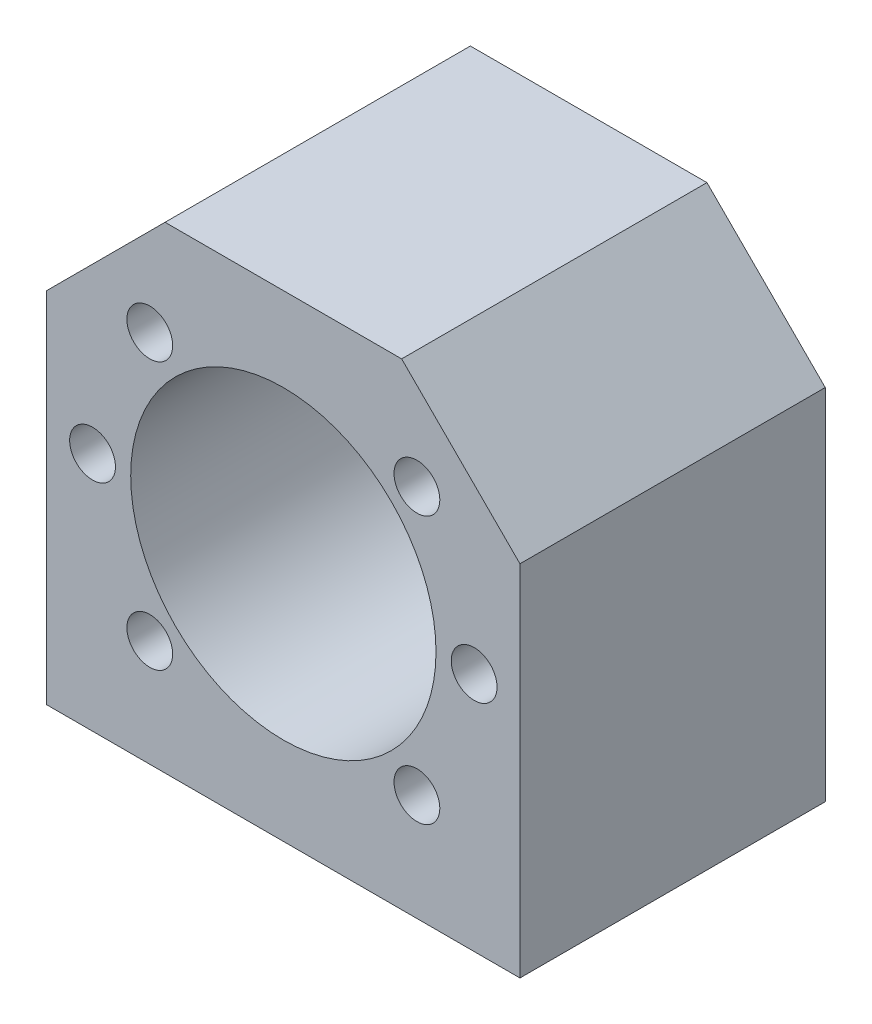
ISO-10303-21;
HEADER;
FILE_DESCRIPTION(('STEP AP214'),'2;1');
FILE_NAME('part.step','',(''),(''),'','','');
FILE_SCHEMA(('AUTOMOTIVE_DESIGN { 1 0 10303 214 1 1 1 1 }'));
ENDSEC;
DATA;
#1=APPLICATION_CONTEXT('core data for automotive mechanical design processes');
#2=APPLICATION_PROTOCOL_DEFINITION('international standard','automotive_design',2000,#1);
#3=PRODUCT_CONTEXT('',#1,'mechanical');
#4=PRODUCT('Part','Part','',(#3));
#5=PRODUCT_RELATED_PRODUCT_CATEGORY('part','',(#4));
#6=PRODUCT_DEFINITION_FORMATION('','',#4);
#7=PRODUCT_DEFINITION_CONTEXT('part definition',#1,'design');
#8=PRODUCT_DEFINITION('design','',#6,#7);
#9=PRODUCT_DEFINITION_SHAPE('','',#8);
#10=(LENGTH_UNIT() NAMED_UNIT(*) SI_UNIT(.MILLI.,.METRE.));
#11=(NAMED_UNIT(*) PLANE_ANGLE_UNIT() SI_UNIT($,.RADIAN.));
#12=(NAMED_UNIT(*) SI_UNIT($,.STERADIAN.) SOLID_ANGLE_UNIT());
#13=UNCERTAINTY_MEASURE_WITH_UNIT(LENGTH_MEASURE(1.E-05),#10,'distance_accuracy_value','');
#14=(GEOMETRIC_REPRESENTATION_CONTEXT(3) GLOBAL_UNCERTAINTY_ASSIGNED_CONTEXT((#13)) GLOBAL_UNIT_ASSIGNED_CONTEXT((#10,
#11,#12)) REPRESENTATION_CONTEXT('',''));
#15=CARTESIAN_POINT('',(0.,0.,0.));
#16=DIRECTION('',(0.,0.,1.));
#17=DIRECTION('',(1.,0.,0.));
#18=AXIS2_PLACEMENT_3D('',#15,#16,#17);
#19=CARTESIAN_POINT('',(31.,-31.4999999999999,40.));
#20=DIRECTION('',(0.,1.,0.));
#21=DIRECTION('',(-1.,0.,0.));
#22=AXIS2_PLACEMENT_3D('',#19,#20,#21);
#23=PLANE('',#22);
#24=CARTESIAN_POINT('',(-26.,-31.4999999999999,7.));
#25=DIRECTION('',(0.,-1.,0.));
#26=DIRECTION('',(1.,0.,0.));
#27=AXIS2_PLACEMENT_3D('',#24,#25,#26);
#28=CIRCLE('',#27,2.99999999999999);
#29=CARTESIAN_POINT('',(-23.,-31.4999999999999,7.));
#30=VERTEX_POINT('',#29);
#31=EDGE_CURVE('E164',#30,#30,#28,.T.);
#32=ORIENTED_EDGE('',*,*,#31,.F.);
#33=EDGE_LOOP('',(#32));
#34=FACE_BOUND('',#33,.T.);
#35=CARTESIAN_POINT('',(26.,-31.4999999999999,33.));
#36=DIRECTION('',(0.,-1.,0.));
#37=DIRECTION('',(1.,0.,0.));
#38=AXIS2_PLACEMENT_3D('',#35,#36,#37);
#39=CIRCLE('',#38,3.);
#40=CARTESIAN_POINT('',(29.,-31.4999999999999,33.));
#41=VERTEX_POINT('',#40);
#42=EDGE_CURVE('E168',#41,#41,#39,.T.);
#43=ORIENTED_EDGE('',*,*,#42,.F.);
#44=EDGE_LOOP('',(#43));
#45=FACE_BOUND('',#44,.T.);
#46=CARTESIAN_POINT('',(26.,-31.4999999999999,7.));
#47=DIRECTION('',(0.,-1.,0.));
#48=DIRECTION('',(1.,0.,0.));
#49=AXIS2_PLACEMENT_3D('',#46,#47,#48);
#50=CIRCLE('',#49,3.);
#51=CARTESIAN_POINT('',(29.,-31.4999999999999,7.));
#52=VERTEX_POINT('',#51);
#53=EDGE_CURVE('E172',#52,#52,#50,.T.);
#54=ORIENTED_EDGE('',*,*,#53,.F.);
#55=EDGE_LOOP('',(#54));
#56=FACE_BOUND('',#55,.T.);
#57=CARTESIAN_POINT('',(-26.,-31.4999999999999,33.));
#58=DIRECTION('',(0.,-1.,0.));
#59=DIRECTION('',(1.,0.,0.));
#60=AXIS2_PLACEMENT_3D('',#57,#58,#59);
#61=CIRCLE('',#60,3.);
#62=CARTESIAN_POINT('',(-23.,-31.4999999999999,33.));
#63=VERTEX_POINT('',#62);
#64=EDGE_CURVE('E175',#63,#63,#61,.T.);
#65=ORIENTED_EDGE('',*,*,#64,.F.);
#66=EDGE_LOOP('',(#65));
#67=FACE_BOUND('',#66,.T.);
#68=DIRECTION('',(1.,0.,0.));
#69=VECTOR('',#68,1.);
#70=CARTESIAN_POINT('',(31.,-31.4999999999999,0.));
#71=LINE('',#70,#69);
#72=CARTESIAN_POINT('',(-31.,-31.4999999999999,0.));
#73=VERTEX_POINT('',#72);
#74=CARTESIAN_POINT('',(31.,-31.4999999999999,0.));
#75=VERTEX_POINT('',#74);
#76=EDGE_CURVE('E118',#73,#75,#71,.T.);
#77=ORIENTED_EDGE('',*,*,#76,.T.);
#78=DIRECTION('',(0.,0.,-1.));
#79=VECTOR('',#78,1.);
#80=CARTESIAN_POINT('',(31.,-31.4999999999999,40.));
#81=LINE('',#80,#79);
#82=CARTESIAN_POINT('',(31.,-31.4999999999999,40.));
#83=VERTEX_POINT('',#82);
#84=EDGE_CURVE('E11',#83,#75,#81,.T.);
#85=ORIENTED_EDGE('',*,*,#84,.F.);
#86=DIRECTION('',(1.,0.,0.));
#87=VECTOR('',#86,1.);
#88=CARTESIAN_POINT('',(31.,-31.4999999999999,40.));
#89=LINE('',#88,#87);
#90=CARTESIAN_POINT('',(-31.,-31.4999999999999,40.));
#91=VERTEX_POINT('',#90);
#92=EDGE_CURVE('E129',#91,#83,#89,.T.);
#93=ORIENTED_EDGE('',*,*,#92,.F.);
#94=DIRECTION('',(0.,0.,-1.));
#95=VECTOR('',#94,1.);
#96=CARTESIAN_POINT('',(-31.,-31.4999999999999,40.));
#97=LINE('',#96,#95);
#98=EDGE_CURVE('E114',#91,#73,#97,.T.);
#99=ORIENTED_EDGE('',*,*,#98,.T.);
#100=EDGE_LOOP('',(#77,#85,#93,#99));
#101=FACE_BOUND('',#100,.T.);
#102=ADVANCED_FACE('F34',(#34,#45,#56,#67,#101),#23,.F.);
#103=CARTESIAN_POINT('',(31.,-31.4999999999999,40.));
#104=DIRECTION('',(-1.,0.,0.));
#105=DIRECTION('',(0.,0.,1.));
#106=AXIS2_PLACEMENT_3D('',#103,#104,#105);
#107=PLANE('',#106);
#108=DIRECTION('',(0.,1.,0.));
#109=VECTOR('',#108,1.);
#110=CARTESIAN_POINT('',(31.,-31.4999999999999,0.));
#111=LINE('',#110,#109);
#112=CARTESIAN_POINT('',(31.,15.5000000000001,0.));
#113=VERTEX_POINT('',#112);
#114=EDGE_CURVE('E121',#75,#113,#111,.T.);
#115=ORIENTED_EDGE('',*,*,#114,.T.);
#116=DIRECTION('',(0.,0.,-1.));
#117=VECTOR('',#116,1.);
#118=CARTESIAN_POINT('',(31.,15.5000000000001,40.));
#119=LINE('',#118,#117);
#120=CARTESIAN_POINT('',(31.,15.5000000000001,40.));
#121=VERTEX_POINT('',#120);
#122=EDGE_CURVE('E42',#121,#113,#119,.T.);
#123=ORIENTED_EDGE('',*,*,#122,.F.);
#124=DIRECTION('',(0.,1.,0.));
#125=VECTOR('',#124,1.);
#126=CARTESIAN_POINT('',(31.,-31.4999999999999,40.));
#127=LINE('',#126,#125);
#128=EDGE_CURVE('E87',#83,#121,#127,.T.);
#129=ORIENTED_EDGE('',*,*,#128,.F.);
#130=ORIENTED_EDGE('',*,*,#84,.T.);
#131=EDGE_LOOP('',(#115,#123,#129,#130));
#132=FACE_BOUND('',#131,.T.);
#133=ADVANCED_FACE('F154',(#132),#107,.F.);
#134=CARTESIAN_POINT('',(31.,15.5000000000001,40.));
#135=DIRECTION('',(-0.707106781186546,-0.707106781186549,0.));
#136=DIRECTION('',(0.707106781186549,-0.707106781186546,0.));
#137=AXIS2_PLACEMENT_3D('',#134,#135,#136);
#138=PLANE('',#137);
#139=DIRECTION('',(-0.707106781186549,0.707106781186546,0.));
#140=VECTOR('',#139,1.);
#141=CARTESIAN_POINT('',(31.,15.5000000000001,0.));
#142=LINE('',#141,#140);
#143=CARTESIAN_POINT('',(15.5,31.,0.));
#144=VERTEX_POINT('',#143);
#145=EDGE_CURVE('E124',#113,#144,#142,.T.);
#146=ORIENTED_EDGE('',*,*,#145,.T.);
#147=DIRECTION('',(0.,0.,-1.));
#148=VECTOR('',#147,1.);
#149=CARTESIAN_POINT('',(15.5,31.,40.));
#150=LINE('',#149,#148);
#151=CARTESIAN_POINT('',(15.5,31.,40.));
#152=VERTEX_POINT('',#151);
#153=EDGE_CURVE('E109',#152,#144,#150,.T.);
#154=ORIENTED_EDGE('',*,*,#153,.F.);
#155=DIRECTION('',(-0.707106781186549,0.707106781186546,0.));
#156=VECTOR('',#155,1.);
#157=CARTESIAN_POINT('',(31.,15.5000000000001,40.));
#158=LINE('',#157,#156);
#159=EDGE_CURVE('E100',#121,#152,#158,.T.);
#160=ORIENTED_EDGE('',*,*,#159,.F.);
#161=ORIENTED_EDGE('',*,*,#122,.T.);
#162=EDGE_LOOP('',(#146,#154,#160,#161));
#163=FACE_BOUND('',#162,.T.);
#164=ADVANCED_FACE('F135',(#163),#138,.F.);
#165=CARTESIAN_POINT('',(15.5,31.,40.));
#166=DIRECTION('',(0.,-1.,0.));
#167=DIRECTION('',(1.,0.,0.));
#168=AXIS2_PLACEMENT_3D('',#165,#166,#167);
#169=PLANE('',#168);
#170=DIRECTION('',(-1.,0.,0.));
#171=VECTOR('',#170,1.);
#172=CARTESIAN_POINT('',(15.5,31.,0.));
#173=LINE('',#172,#171);
#174=CARTESIAN_POINT('',(-15.5,31.,0.));
#175=VERTEX_POINT('',#174);
#176=EDGE_CURVE('E108',#144,#175,#173,.T.);
#177=ORIENTED_EDGE('',*,*,#176,.T.);
#178=DIRECTION('',(0.,0.,-1.));
#179=VECTOR('',#178,1.);
#180=CARTESIAN_POINT('',(-15.5,31.,40.));
#181=LINE('',#180,#179);
#182=CARTESIAN_POINT('',(-15.5,31.,40.));
#183=VERTEX_POINT('',#182);
#184=EDGE_CURVE('E105',#183,#175,#181,.T.);
#185=ORIENTED_EDGE('',*,*,#184,.F.);
#186=DIRECTION('',(-1.,0.,0.));
#187=VECTOR('',#186,1.);
#188=CARTESIAN_POINT('',(15.5,31.,40.));
#189=LINE('',#188,#187);
#190=EDGE_CURVE('E94',#152,#183,#189,.T.);
#191=ORIENTED_EDGE('',*,*,#190,.F.);
#192=ORIENTED_EDGE('',*,*,#153,.T.);
#193=EDGE_LOOP('',(#177,#185,#191,#192));
#194=FACE_BOUND('',#193,.T.);
#195=ADVANCED_FACE('F106',(#194),#169,.F.);
#196=CARTESIAN_POINT('',(-15.5,31.,40.));
#197=DIRECTION('',(0.707106781186545,-0.70710678118655,0.));
#198=DIRECTION('',(0.70710678118655,0.707106781186545,0.));
#199=AXIS2_PLACEMENT_3D('',#196,#197,#198);
#200=PLANE('',#199);
#201=DIRECTION('',(-0.70710678118655,-0.707106781186545,0.));
#202=VECTOR('',#201,1.);
#203=CARTESIAN_POINT('',(-15.5,31.,0.));
#204=LINE('',#203,#202);
#205=CARTESIAN_POINT('',(-31.,15.5000000000001,0.));
#206=VERTEX_POINT('',#205);
#207=EDGE_CURVE('E73',#175,#206,#204,.T.);
#208=ORIENTED_EDGE('',*,*,#207,.T.);
#209=DIRECTION('',(0.,0.,-1.));
#210=VECTOR('',#209,1.);
#211=CARTESIAN_POINT('',(-31.,15.5000000000001,40.));
#212=LINE('',#211,#210);
#213=CARTESIAN_POINT('',(-31.,15.5000000000001,40.));
#214=VERTEX_POINT('',#213);
#215=EDGE_CURVE('E110',#214,#206,#212,.T.);
#216=ORIENTED_EDGE('',*,*,#215,.F.);
#217=DIRECTION('',(-0.70710678118655,-0.707106781186545,0.));
#218=VECTOR('',#217,1.);
#219=CARTESIAN_POINT('',(-15.5,31.,40.));
#220=LINE('',#219,#218);
#221=EDGE_CURVE('E98',#183,#214,#220,.T.);
#222=ORIENTED_EDGE('',*,*,#221,.F.);
#223=ORIENTED_EDGE('',*,*,#184,.T.);
#224=EDGE_LOOP('',(#208,#216,#222,#223));
#225=FACE_BOUND('',#224,.T.);
#226=ADVANCED_FACE('F112',(#225),#200,.F.);
#227=CARTESIAN_POINT('',(-31.,15.5000000000001,40.));
#228=DIRECTION('',(1.,0.,0.));
#229=DIRECTION('',(0.,1.,0.));
#230=AXIS2_PLACEMENT_3D('',#227,#228,#229);
#231=PLANE('',#230);
#232=DIRECTION('',(0.,-1.,0.));
#233=VECTOR('',#232,1.);
#234=CARTESIAN_POINT('',(-31.,15.5000000000001,0.));
#235=LINE('',#234,#233);
#236=EDGE_CURVE('E79',#206,#73,#235,.T.);
#237=ORIENTED_EDGE('',*,*,#236,.T.);
#238=ORIENTED_EDGE('',*,*,#98,.F.);
#239=DIRECTION('',(0.,-1.,0.));
#240=VECTOR('',#239,1.);
#241=CARTESIAN_POINT('',(-31.,15.5000000000001,40.));
#242=LINE('',#241,#240);
#243=EDGE_CURVE('E50',#214,#91,#242,.T.);
#244=ORIENTED_EDGE('',*,*,#243,.F.);
#245=ORIENTED_EDGE('',*,*,#215,.T.);
#246=EDGE_LOOP('',(#237,#238,#244,#245));
#247=FACE_BOUND('',#246,.T.);
#248=ADVANCED_FACE('F142',(#247),#231,.F.);
#249=CARTESIAN_POINT('',(0.,0.,40.));
#250=DIRECTION('',(0.,0.,1.));
#251=DIRECTION('',(1.,0.,0.));
#252=AXIS2_PLACEMENT_3D('',#249,#250,#251);
#253=PLANE('',#252);
#254=CARTESIAN_POINT('',(-17.5,-17.5,40.));
#255=DIRECTION('',(0.,0.,1.));
#256=DIRECTION('',(1.,0.,0.));
#257=AXIS2_PLACEMENT_3D('',#254,#255,#256);
#258=CIRCLE('',#257,3.);
#259=CARTESIAN_POINT('',(-14.5,-17.5,40.));
#260=VERTEX_POINT('',#259);
#261=EDGE_CURVE('E181',#260,#260,#258,.T.);
#262=ORIENTED_EDGE('',*,*,#261,.F.);
#263=EDGE_LOOP('',(#262));
#264=FACE_BOUND('',#263,.T.);
#265=CARTESIAN_POINT('',(-17.5,17.5,40.));
#266=DIRECTION('',(0.,0.,1.));
#267=DIRECTION('',(1.,0.,0.));
#268=AXIS2_PLACEMENT_3D('',#265,#266,#267);
#269=CIRCLE('',#268,3.);
#270=CARTESIAN_POINT('',(-14.5,17.5,40.));
#271=VERTEX_POINT('',#270);
#272=EDGE_CURVE('E209',#271,#271,#269,.T.);
#273=ORIENTED_EDGE('',*,*,#272,.F.);
#274=EDGE_LOOP('',(#273));
#275=FACE_BOUND('',#274,.T.);
#276=CARTESIAN_POINT('',(-25.,0.,40.));
#277=DIRECTION('',(0.,0.,1.));
#278=DIRECTION('',(1.,0.,0.));
#279=AXIS2_PLACEMENT_3D('',#276,#277,#278);
#280=CIRCLE('',#279,3.);
#281=CARTESIAN_POINT('',(-22.,0.,40.));
#282=VERTEX_POINT('',#281);
#283=EDGE_CURVE('E203',#282,#282,#280,.T.);
#284=ORIENTED_EDGE('',*,*,#283,.F.);
#285=EDGE_LOOP('',(#284));
#286=FACE_BOUND('',#285,.T.);
#287=CARTESIAN_POINT('',(17.5,17.5,40.));
#288=DIRECTION('',(0.,0.,1.));
#289=DIRECTION('',(1.,0.,0.));
#290=AXIS2_PLACEMENT_3D('',#287,#288,#289);
#291=CIRCLE('',#290,3.);
#292=CARTESIAN_POINT('',(20.5,17.5,40.));
#293=VERTEX_POINT('',#292);
#294=EDGE_CURVE('E197',#293,#293,#291,.T.);
#295=ORIENTED_EDGE('',*,*,#294,.F.);
#296=EDGE_LOOP('',(#295));
#297=FACE_BOUND('',#296,.T.);
#298=CARTESIAN_POINT('',(25.,0.,40.));
#299=DIRECTION('',(0.,0.,1.));
#300=DIRECTION('',(1.,0.,0.));
#301=AXIS2_PLACEMENT_3D('',#298,#299,#300);
#302=CIRCLE('',#301,3.00000000000002);
#303=CARTESIAN_POINT('',(28.,0.,40.));
#304=VERTEX_POINT('',#303);
#305=EDGE_CURVE('E191',#304,#304,#302,.T.);
#306=ORIENTED_EDGE('',*,*,#305,.F.);
#307=EDGE_LOOP('',(#306));
#308=FACE_BOUND('',#307,.T.);
#309=CARTESIAN_POINT('',(17.5,-17.5,40.));
#310=DIRECTION('',(0.,0.,1.));
#311=DIRECTION('',(1.,0.,0.));
#312=AXIS2_PLACEMENT_3D('',#309,#310,#311);
#313=CIRCLE('',#312,3.);
#314=CARTESIAN_POINT('',(20.5,-17.5,40.));
#315=VERTEX_POINT('',#314);
#316=EDGE_CURVE('E190',#315,#315,#313,.T.);
#317=ORIENTED_EDGE('',*,*,#316,.F.);
#318=EDGE_LOOP('',(#317));
#319=FACE_BOUND('',#318,.T.);
#320=CARTESIAN_POINT('',(0.,0.,40.));
#321=DIRECTION('',(0.,0.,1.));
#322=DIRECTION('',(1.,0.,0.));
#323=AXIS2_PLACEMENT_3D('',#320,#321,#322);
#324=CIRCLE('',#323,20.0000000000007);
#325=CARTESIAN_POINT('',(20.0000000000007,0.,40.));
#326=VERTEX_POINT('',#325);
#327=EDGE_CURVE('E220',#326,#326,#324,.T.);
#328=ORIENTED_EDGE('',*,*,#327,.F.);
#329=EDGE_LOOP('',(#328));
#330=FACE_BOUND('',#329,.T.);
#331=ORIENTED_EDGE('',*,*,#92,.T.);
#332=ORIENTED_EDGE('',*,*,#128,.T.);
#333=ORIENTED_EDGE('',*,*,#159,.T.);
#334=ORIENTED_EDGE('',*,*,#190,.T.);
#335=ORIENTED_EDGE('',*,*,#221,.T.);
#336=ORIENTED_EDGE('',*,*,#243,.T.);
#337=EDGE_LOOP('',(#331,#332,#333,#334,#335,#336));
#338=FACE_BOUND('',#337,.T.);
#339=ADVANCED_FACE('F96',(#264,#275,#286,#297,#308,#319,#330,#338),#253,.T.);
#340=CARTESIAN_POINT('',(0.,0.,0.));
#341=DIRECTION('',(0.,0.,1.));
#342=DIRECTION('',(1.,0.,0.));
#343=AXIS2_PLACEMENT_3D('',#340,#341,#342);
#344=PLANE('',#343);
#345=CARTESIAN_POINT('',(0.,0.,0.));
#346=DIRECTION('',(0.,0.,1.));
#347=DIRECTION('',(1.,0.,0.));
#348=AXIS2_PLACEMENT_3D('',#345,#346,#347);
#349=CIRCLE('',#348,20.0000000000007);
#350=CARTESIAN_POINT('',(20.0000000000007,0.,0.));
#351=VERTEX_POINT('',#350);
#352=EDGE_CURVE('E122',#351,#351,#349,.T.);
#353=ORIENTED_EDGE('',*,*,#352,.T.);
#354=EDGE_LOOP('',(#353));
#355=FACE_BOUND('',#354,.T.);
#356=ORIENTED_EDGE('',*,*,#76,.F.);
#357=ORIENTED_EDGE('',*,*,#236,.F.);
#358=ORIENTED_EDGE('',*,*,#207,.F.);
#359=ORIENTED_EDGE('',*,*,#176,.F.);
#360=ORIENTED_EDGE('',*,*,#145,.F.);
#361=ORIENTED_EDGE('',*,*,#114,.F.);
#362=EDGE_LOOP('',(#356,#357,#358,#359,#360,#361));
#363=FACE_BOUND('',#362,.T.);
#364=ADVANCED_FACE('F138',(#355,#363),#344,.F.);
#365=CARTESIAN_POINT('',(0.,0.,0.));
#366=DIRECTION('',(0.,0.,1.));
#367=DIRECTION('',(1.,0.,0.));
#368=AXIS2_PLACEMENT_3D('',#365,#366,#367);
#369=CYLINDRICAL_SURFACE('',#368,20.0000000000007);
#370=ORIENTED_EDGE('',*,*,#352,.F.);
#371=EDGE_LOOP('',(#370));
#372=FACE_BOUND('',#371,.T.);
#373=ORIENTED_EDGE('',*,*,#327,.T.);
#374=EDGE_LOOP('',(#373));
#375=FACE_BOUND('',#374,.T.);
#376=ADVANCED_FACE('F230',(#372,#375),#369,.F.);
#377=CARTESIAN_POINT('',(17.5,-17.5,15.));
#378=DIRECTION('',(0.,0.,1.));
#379=DIRECTION('',(1.,0.,0.));
#380=AXIS2_PLACEMENT_3D('',#377,#378,#379);
#381=CYLINDRICAL_SURFACE('',#380,3.);
#382=CARTESIAN_POINT('',(17.5,-17.5,15.));
#383=DIRECTION('',(0.,0.,1.));
#384=DIRECTION('',(1.,0.,0.));
#385=AXIS2_PLACEMENT_3D('',#382,#383,#384);
#386=CIRCLE('',#385,3.);
#387=CARTESIAN_POINT('',(20.5,-17.5,15.));
#388=VERTEX_POINT('',#387);
#389=EDGE_CURVE('E217',#388,#388,#386,.T.);
#390=ORIENTED_EDGE('',*,*,#389,.F.);
#391=EDGE_LOOP('',(#390));
#392=FACE_BOUND('',#391,.T.);
#393=ORIENTED_EDGE('',*,*,#316,.T.);
#394=EDGE_LOOP('',(#393));
#395=FACE_BOUND('',#394,.T.);
#396=ADVANCED_FACE('F233',(#392,#395),#381,.F.);
#397=CARTESIAN_POINT('',(17.5,-17.5,15.));
#398=DIRECTION('',(0.,0.,1.));
#399=DIRECTION('',(1.,0.,0.));
#400=AXIS2_PLACEMENT_3D('',#397,#398,#399);
#401=PLANE('',#400);
#402=ORIENTED_EDGE('',*,*,#389,.T.);
#403=EDGE_LOOP('',(#402));
#404=FACE_BOUND('',#403,.T.);
#405=ADVANCED_FACE('F240',(#404),#401,.T.);
#406=CARTESIAN_POINT('',(25.,0.,15.));
#407=DIRECTION('',(0.,0.,1.));
#408=DIRECTION('',(1.,0.,0.));
#409=AXIS2_PLACEMENT_3D('',#406,#407,#408);
#410=CYLINDRICAL_SURFACE('',#409,3.00000000000002);
#411=CARTESIAN_POINT('',(25.,0.,15.));
#412=DIRECTION('',(0.,0.,1.));
#413=DIRECTION('',(1.,0.,0.));
#414=AXIS2_PLACEMENT_3D('',#411,#412,#413);
#415=CIRCLE('',#414,3.00000000000002);
#416=CARTESIAN_POINT('',(28.,0.,15.));
#417=VERTEX_POINT('',#416);
#418=EDGE_CURVE('E187',#417,#417,#415,.T.);
#419=ORIENTED_EDGE('',*,*,#418,.F.);
#420=EDGE_LOOP('',(#419));
#421=FACE_BOUND('',#420,.T.);
#422=ORIENTED_EDGE('',*,*,#305,.T.);
#423=EDGE_LOOP('',(#422));
#424=FACE_BOUND('',#423,.T.);
#425=ADVANCED_FACE('F248',(#421,#424),#410,.F.);
#426=CARTESIAN_POINT('',(25.,0.,15.));
#427=DIRECTION('',(0.,0.,1.));
#428=DIRECTION('',(1.,0.,0.));
#429=AXIS2_PLACEMENT_3D('',#426,#427,#428);
#430=PLANE('',#429);
#431=ORIENTED_EDGE('',*,*,#418,.T.);
#432=EDGE_LOOP('',(#431));
#433=FACE_BOUND('',#432,.T.);
#434=ADVANCED_FACE('F279',(#433),#430,.T.);
#435=CARTESIAN_POINT('',(17.5,17.5,15.));
#436=DIRECTION('',(0.,0.,1.));
#437=DIRECTION('',(1.,0.,0.));
#438=AXIS2_PLACEMENT_3D('',#435,#436,#437);
#439=CYLINDRICAL_SURFACE('',#438,3.);
#440=CARTESIAN_POINT('',(17.5,17.5,15.));
#441=DIRECTION('',(0.,0.,1.));
#442=DIRECTION('',(1.,0.,0.));
#443=AXIS2_PLACEMENT_3D('',#440,#441,#442);
#444=CIRCLE('',#443,3.);
#445=CARTESIAN_POINT('',(20.5,17.5,15.));
#446=VERTEX_POINT('',#445);
#447=EDGE_CURVE('E194',#446,#446,#444,.T.);
#448=ORIENTED_EDGE('',*,*,#447,.F.);
#449=EDGE_LOOP('',(#448));
#450=FACE_BOUND('',#449,.T.);
#451=ORIENTED_EDGE('',*,*,#294,.T.);
#452=EDGE_LOOP('',(#451));
#453=FACE_BOUND('',#452,.T.);
#454=ADVANCED_FACE('F276',(#450,#453),#439,.F.);
#455=CARTESIAN_POINT('',(17.5,17.5,15.));
#456=DIRECTION('',(0.,0.,1.));
#457=DIRECTION('',(1.,0.,0.));
#458=AXIS2_PLACEMENT_3D('',#455,#456,#457);
#459=PLANE('',#458);
#460=ORIENTED_EDGE('',*,*,#447,.T.);
#461=EDGE_LOOP('',(#460));
#462=FACE_BOUND('',#461,.T.);
#463=ADVANCED_FACE('F271',(#462),#459,.T.);
#464=CARTESIAN_POINT('',(-25.,0.,15.));
#465=DIRECTION('',(0.,0.,1.));
#466=DIRECTION('',(1.,0.,0.));
#467=AXIS2_PLACEMENT_3D('',#464,#465,#466);
#468=CYLINDRICAL_SURFACE('',#467,3.);
#469=CARTESIAN_POINT('',(-25.,0.,15.));
#470=DIRECTION('',(0.,0.,1.));
#471=DIRECTION('',(1.,0.,0.));
#472=AXIS2_PLACEMENT_3D('',#469,#470,#471);
#473=CIRCLE('',#472,3.);
#474=CARTESIAN_POINT('',(-22.,0.,15.));
#475=VERTEX_POINT('',#474);
#476=EDGE_CURVE('E200',#475,#475,#473,.T.);
#477=ORIENTED_EDGE('',*,*,#476,.F.);
#478=EDGE_LOOP('',(#477));
#479=FACE_BOUND('',#478,.T.);
#480=ORIENTED_EDGE('',*,*,#283,.T.);
#481=EDGE_LOOP('',(#480));
#482=FACE_BOUND('',#481,.T.);
#483=ADVANCED_FACE('F268',(#479,#482),#468,.F.);
#484=CARTESIAN_POINT('',(-25.,0.,15.));
#485=DIRECTION('',(0.,0.,1.));
#486=DIRECTION('',(1.,0.,0.));
#487=AXIS2_PLACEMENT_3D('',#484,#485,#486);
#488=PLANE('',#487);
#489=ORIENTED_EDGE('',*,*,#476,.T.);
#490=EDGE_LOOP('',(#489));
#491=FACE_BOUND('',#490,.T.);
#492=ADVANCED_FACE('F263',(#491),#488,.T.);
#493=CARTESIAN_POINT('',(-17.5,17.5,15.));
#494=DIRECTION('',(0.,0.,1.));
#495=DIRECTION('',(1.,0.,0.));
#496=AXIS2_PLACEMENT_3D('',#493,#494,#495);
#497=CYLINDRICAL_SURFACE('',#496,3.);
#498=CARTESIAN_POINT('',(-17.5,17.5,15.));
#499=DIRECTION('',(0.,0.,1.));
#500=DIRECTION('',(1.,0.,0.));
#501=AXIS2_PLACEMENT_3D('',#498,#499,#500);
#502=CIRCLE('',#501,3.);
#503=CARTESIAN_POINT('',(-14.5,17.5,15.));
#504=VERTEX_POINT('',#503);
#505=EDGE_CURVE('E206',#504,#504,#502,.T.);
#506=ORIENTED_EDGE('',*,*,#505,.F.);
#507=EDGE_LOOP('',(#506));
#508=FACE_BOUND('',#507,.T.);
#509=ORIENTED_EDGE('',*,*,#272,.T.);
#510=EDGE_LOOP('',(#509));
#511=FACE_BOUND('',#510,.T.);
#512=ADVANCED_FACE('F260',(#508,#511),#497,.F.);
#513=CARTESIAN_POINT('',(-17.5,17.5,15.));
#514=DIRECTION('',(0.,0.,1.));
#515=DIRECTION('',(1.,0.,0.));
#516=AXIS2_PLACEMENT_3D('',#513,#514,#515);
#517=PLANE('',#516);
#518=ORIENTED_EDGE('',*,*,#505,.T.);
#519=EDGE_LOOP('',(#518));
#520=FACE_BOUND('',#519,.T.);
#521=ADVANCED_FACE('F254',(#520),#517,.T.);
#522=CARTESIAN_POINT('',(-17.5,-17.5,15.));
#523=DIRECTION('',(0.,0.,1.));
#524=DIRECTION('',(1.,0.,0.));
#525=AXIS2_PLACEMENT_3D('',#522,#523,#524);
#526=CYLINDRICAL_SURFACE('',#525,3.);
#527=CARTESIAN_POINT('',(-17.5,-17.5,15.));
#528=DIRECTION('',(0.,0.,1.));
#529=DIRECTION('',(1.,0.,0.));
#530=AXIS2_PLACEMENT_3D('',#527,#528,#529);
#531=CIRCLE('',#530,3.);
#532=CARTESIAN_POINT('',(-14.5,-17.5,15.));
#533=VERTEX_POINT('',#532);
#534=EDGE_CURVE('E212',#533,#533,#531,.T.);
#535=ORIENTED_EDGE('',*,*,#534,.F.);
#536=EDGE_LOOP('',(#535));
#537=FACE_BOUND('',#536,.T.);
#538=ORIENTED_EDGE('',*,*,#261,.T.);
#539=EDGE_LOOP('',(#538));
#540=FACE_BOUND('',#539,.T.);
#541=ADVANCED_FACE('F250',(#537,#540),#526,.F.);
#542=CARTESIAN_POINT('',(-17.5,-17.5,15.));
#543=DIRECTION('',(0.,0.,1.));
#544=DIRECTION('',(1.,0.,0.));
#545=AXIS2_PLACEMENT_3D('',#542,#543,#544);
#546=PLANE('',#545);
#547=ORIENTED_EDGE('',*,*,#534,.T.);
#548=EDGE_LOOP('',(#547));
#549=FACE_BOUND('',#548,.T.);
#550=ADVANCED_FACE('F253',(#549),#546,.T.);
#551=CARTESIAN_POINT('',(-26.,-6.49999999999994,33.));
#552=DIRECTION('',(0.,-1.,0.));
#553=DIRECTION('',(1.,0.,0.));
#554=AXIS2_PLACEMENT_3D('',#551,#552,#553);
#555=CYLINDRICAL_SURFACE('',#554,3.);
#556=CARTESIAN_POINT('',(-26.,-6.49999999999994,33.));
#557=DIRECTION('',(0.,-1.,0.));
#558=DIRECTION('',(1.,0.,0.));
#559=AXIS2_PLACEMENT_3D('',#556,#557,#558);
#560=CIRCLE('',#559,3.);
#561=CARTESIAN_POINT('',(-23.,-6.49999999999994,33.));
#562=VERTEX_POINT('',#561);
#563=EDGE_CURVE('E177',#562,#562,#560,.T.);
#564=ORIENTED_EDGE('',*,*,#563,.F.);
#565=EDGE_LOOP('',(#564));
#566=FACE_BOUND('',#565,.T.);
#567=ORIENTED_EDGE('',*,*,#64,.T.);
#568=EDGE_LOOP('',(#567));
#569=FACE_BOUND('',#568,.T.);
#570=ADVANCED_FACE('F258',(#566,#569),#555,.F.);
#571=CARTESIAN_POINT('',(-26.,-6.49999999999994,33.));
#572=DIRECTION('',(0.,-1.,0.));
#573=DIRECTION('',(1.,0.,0.));
#574=AXIS2_PLACEMENT_3D('',#571,#572,#573);
#575=PLANE('',#574);
#576=ORIENTED_EDGE('',*,*,#563,.T.);
#577=EDGE_LOOP('',(#576));
#578=FACE_BOUND('',#577,.T.);
#579=ADVANCED_FACE('F292',(#578),#575,.T.);
#580=CARTESIAN_POINT('',(26.,-6.49999999999994,7.));
#581=DIRECTION('',(0.,-1.,0.));
#582=DIRECTION('',(1.,0.,0.));
#583=AXIS2_PLACEMENT_3D('',#580,#581,#582);
#584=CYLINDRICAL_SURFACE('',#583,3.);
#585=CARTESIAN_POINT('',(26.,-6.49999999999994,7.));
#586=DIRECTION('',(0.,-1.,0.));
#587=DIRECTION('',(1.,0.,0.));
#588=AXIS2_PLACEMENT_3D('',#585,#586,#587);
#589=CIRCLE('',#588,3.);
#590=CARTESIAN_POINT('',(29.,-6.49999999999994,7.));
#591=VERTEX_POINT('',#590);
#592=EDGE_CURVE('E324',#591,#591,#589,.T.);
#593=ORIENTED_EDGE('',*,*,#592,.F.);
#594=EDGE_LOOP('',(#593));
#595=FACE_BOUND('',#594,.T.);
#596=ORIENTED_EDGE('',*,*,#53,.T.);
#597=EDGE_LOOP('',(#596));
#598=FACE_BOUND('',#597,.T.);
#599=ADVANCED_FACE('F296',(#595,#598),#584,.F.);
#600=CARTESIAN_POINT('',(26.,-6.49999999999994,7.));
#601=DIRECTION('',(0.,-1.,0.));
#602=DIRECTION('',(1.,0.,0.));
#603=AXIS2_PLACEMENT_3D('',#600,#601,#602);
#604=PLANE('',#603);
#605=ORIENTED_EDGE('',*,*,#592,.T.);
#606=EDGE_LOOP('',(#605));
#607=FACE_BOUND('',#606,.T.);
#608=ADVANCED_FACE('F302',(#607),#604,.T.);
#609=CARTESIAN_POINT('',(26.,-6.49999999999994,33.));
#610=DIRECTION('',(0.,-1.,0.));
#611=DIRECTION('',(1.,0.,0.));
#612=AXIS2_PLACEMENT_3D('',#609,#610,#611);
#613=CYLINDRICAL_SURFACE('',#612,3.);
#614=CARTESIAN_POINT('',(26.,-6.49999999999994,33.));
#615=DIRECTION('',(0.,-1.,0.));
#616=DIRECTION('',(1.,0.,0.));
#617=AXIS2_PLACEMENT_3D('',#614,#615,#616);
#618=CIRCLE('',#617,3.);
#619=CARTESIAN_POINT('',(29.,-6.49999999999994,33.));
#620=VERTEX_POINT('',#619);
#621=EDGE_CURVE('E326',#620,#620,#618,.T.);
#622=ORIENTED_EDGE('',*,*,#621,.F.);
#623=EDGE_LOOP('',(#622));
#624=FACE_BOUND('',#623,.T.);
#625=ORIENTED_EDGE('',*,*,#42,.T.);
#626=EDGE_LOOP('',(#625));
#627=FACE_BOUND('',#626,.T.);
#628=ADVANCED_FACE('F298',(#624,#627),#613,.F.);
#629=CARTESIAN_POINT('',(26.,-6.49999999999994,33.));
#630=DIRECTION('',(0.,-1.,0.));
#631=DIRECTION('',(1.,0.,0.));
#632=AXIS2_PLACEMENT_3D('',#629,#630,#631);
#633=PLANE('',#632);
#634=ORIENTED_EDGE('',*,*,#621,.T.);
#635=EDGE_LOOP('',(#634));
#636=FACE_BOUND('',#635,.T.);
#637=ADVANCED_FACE('F301',(#636),#633,.T.);
#638=CARTESIAN_POINT('',(-26.,-6.49999999999994,7.));
#639=DIRECTION('',(0.,-1.,0.));
#640=DIRECTION('',(1.,0.,0.));
#641=AXIS2_PLACEMENT_3D('',#638,#639,#640);
#642=CYLINDRICAL_SURFACE('',#641,2.99999999999999);
#643=CARTESIAN_POINT('',(-26.,-6.49999999999994,7.));
#644=DIRECTION('',(0.,-1.,0.));
#645=DIRECTION('',(1.,0.,0.));
#646=AXIS2_PLACEMENT_3D('',#643,#644,#645);
#647=CIRCLE('',#646,2.99999999999999);
#648=CARTESIAN_POINT('',(-23.,-6.49999999999994,7.));
#649=VERTEX_POINT('',#648);
#650=EDGE_CURVE('E178',#649,#649,#647,.T.);
#651=ORIENTED_EDGE('',*,*,#650,.F.);
#652=EDGE_LOOP('',(#651));
#653=FACE_BOUND('',#652,.T.);
#654=ORIENTED_EDGE('',*,*,#31,.T.);
#655=EDGE_LOOP('',(#654));
#656=FACE_BOUND('',#655,.T.);
#657=ADVANCED_FACE('F306',(#653,#656),#642,.F.);
#658=CARTESIAN_POINT('',(-26.,-6.49999999999994,7.));
#659=DIRECTION('',(0.,-1.,0.));
#660=DIRECTION('',(1.,0.,0.));
#661=AXIS2_PLACEMENT_3D('',#658,#659,#660);
#662=PLANE('',#661);
#663=ORIENTED_EDGE('',*,*,#650,.T.);
#664=EDGE_LOOP('',(#663));
#665=FACE_BOUND('',#664,.T.);
#666=ADVANCED_FACE('F310',(#665),#662,.T.);
#667=CLOSED_SHELL('',(#102,#133,#164,#195,#226,#248,#339,#364,#376,#396,#405,#425,#434,#454,
#463,#483,#492,#512,#521,#541,#550,#570,#579,#599,#608,#628,#637,#657,#666));
#668=MANIFOLD_SOLID_BREP('B2',#667);
#669=ADVANCED_BREP_SHAPE_REPRESENTATION('',(#18,#668),#14);
#670=SHAPE_DEFINITION_REPRESENTATION(#9,#669);
ENDSEC;
END-ISO-10303-21;
